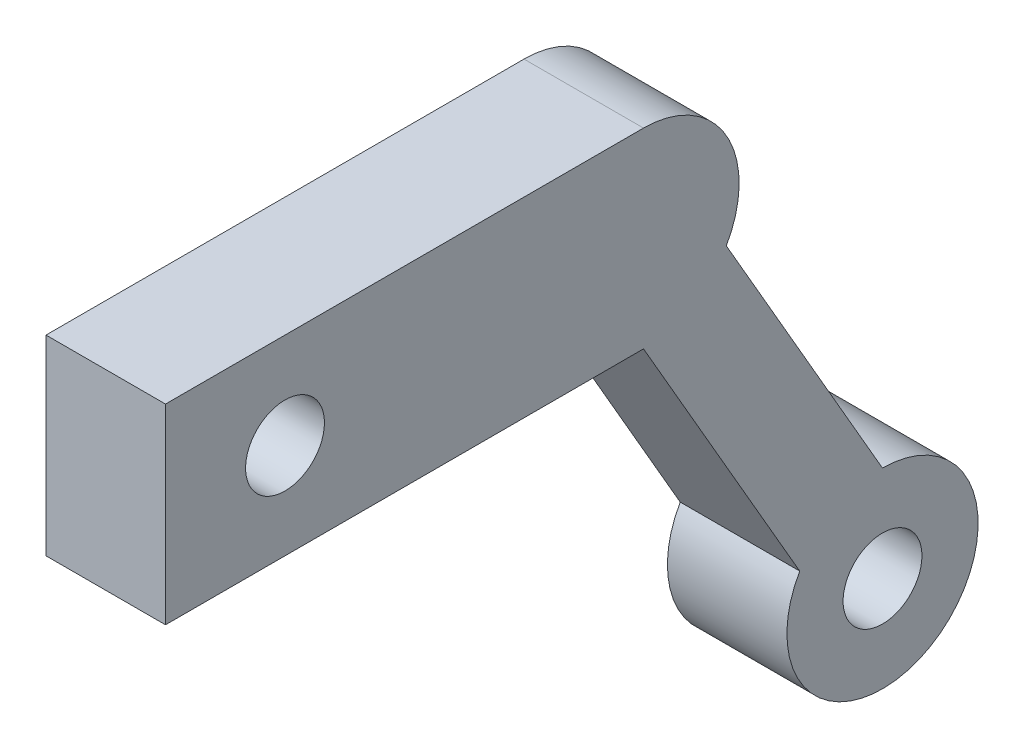
ISO-10303-21;
HEADER;
FILE_DESCRIPTION(('STEP AP214'),'2;1');
FILE_NAME('part.step','',(''),(''),'','','');
FILE_SCHEMA(('AUTOMOTIVE_DESIGN { 1 0 10303 214 1 1 1 1 }'));
ENDSEC;
DATA;
#1=APPLICATION_CONTEXT('core data for automotive mechanical design processes');
#2=APPLICATION_PROTOCOL_DEFINITION('international standard','automotive_design',2000,#1);
#3=PRODUCT_CONTEXT('',#1,'mechanical');
#4=PRODUCT('Part','Part','',(#3));
#5=PRODUCT_RELATED_PRODUCT_CATEGORY('part','',(#4));
#6=PRODUCT_DEFINITION_FORMATION('','',#4);
#7=PRODUCT_DEFINITION_CONTEXT('part definition',#1,'design');
#8=PRODUCT_DEFINITION('design','',#6,#7);
#9=PRODUCT_DEFINITION_SHAPE('','',#8);
#10=(LENGTH_UNIT() NAMED_UNIT(*) SI_UNIT(.MILLI.,.METRE.));
#11=(NAMED_UNIT(*) PLANE_ANGLE_UNIT() SI_UNIT($,.RADIAN.));
#12=(NAMED_UNIT(*) SI_UNIT($,.STERADIAN.) SOLID_ANGLE_UNIT());
#13=UNCERTAINTY_MEASURE_WITH_UNIT(LENGTH_MEASURE(1.E-05),#10,'distance_accuracy_value','');
#14=(GEOMETRIC_REPRESENTATION_CONTEXT(3) GLOBAL_UNCERTAINTY_ASSIGNED_CONTEXT((#13)) GLOBAL_UNIT_ASSIGNED_CONTEXT((#10,
#11,#12)) REPRESENTATION_CONTEXT('',''));
#15=CARTESIAN_POINT('',(0.,0.,0.));
#16=DIRECTION('',(0.,0.,1.));
#17=DIRECTION('',(1.,0.,0.));
#18=AXIS2_PLACEMENT_3D('',#15,#16,#17);
#19=CARTESIAN_POINT('',(5.,-8.,0.));
#20=DIRECTION('',(0.,1.,0.));
#21=DIRECTION('',(0.,0.,1.));
#22=AXIS2_PLACEMENT_3D('',#19,#20,#21);
#23=PLANE('',#22);
#24=DIRECTION('',(0.,0.,-1.));
#25=VECTOR('',#24,1.);
#26=CARTESIAN_POINT('',(0.,-8.,0.));
#27=LINE('',#26,#25);
#28=CARTESIAN_POINT('',(0.,-8.,0.));
#29=VERTEX_POINT('',#28);
#30=CARTESIAN_POINT('',(0.,-8.,-20.));
#31=VERTEX_POINT('',#30);
#32=EDGE_CURVE('E142',#29,#31,#27,.T.);
#33=ORIENTED_EDGE('',*,*,#32,.T.);
#34=DIRECTION('',(-1.,0.,0.));
#35=VECTOR('',#34,1.);
#36=CARTESIAN_POINT('',(5.,-8.,-20.));
#37=LINE('',#36,#35);
#38=CARTESIAN_POINT('',(5.,-8.,-20.));
#39=VERTEX_POINT('',#38);
#40=EDGE_CURVE('E11',#39,#31,#37,.T.);
#41=ORIENTED_EDGE('',*,*,#40,.F.);
#42=DIRECTION('',(0.,0.,-1.));
#43=VECTOR('',#42,1.);
#44=CARTESIAN_POINT('',(5.,-8.,0.));
#45=LINE('',#44,#43);
#46=CARTESIAN_POINT('',(5.,-8.,0.));
#47=VERTEX_POINT('',#46);
#48=EDGE_CURVE('E164',#47,#39,#45,.T.);
#49=ORIENTED_EDGE('',*,*,#48,.F.);
#50=DIRECTION('',(-1.,0.,0.));
#51=VECTOR('',#50,1.);
#52=CARTESIAN_POINT('',(5.,-8.,0.));
#53=LINE('',#52,#51);
#54=EDGE_CURVE('E138',#47,#29,#53,.T.);
#55=ORIENTED_EDGE('',*,*,#54,.T.);
#56=EDGE_LOOP('',(#33,#41,#49,#55));
#57=FACE_BOUND('',#56,.T.);
#58=ADVANCED_FACE('F47',(#57),#23,.F.);
#59=CARTESIAN_POINT('',(5.,6.6602540378444,-11.5358983848622));
#60=DIRECTION('',(0.,0.500000000000002,-0.866025403784438));
#61=DIRECTION('',(0.,0.866025403784438,0.500000000000002));
#62=AXIS2_PLACEMENT_3D('',#59,#60,#61);
#63=PLANE('',#62);
#64=DIRECTION('',(0.,-0.866025403784438,-0.500000000000002));
#65=VECTOR('',#64,1.);
#66=CARTESIAN_POINT('',(0.,6.6602540378444,-11.5358983848622));
#67=LINE('',#66,#65);
#68=CARTESIAN_POINT('',(0.,-19.3205080756887,-26.5358983848623));
#69=VERTEX_POINT('',#68);
#70=EDGE_CURVE('E146',#31,#69,#67,.T.);
#71=ORIENTED_EDGE('',*,*,#70,.T.);
#72=DIRECTION('',(-1.,0.,0.));
#73=VECTOR('',#72,1.);
#74=CARTESIAN_POINT('',(5.,-19.3205080756887,-26.5358983848623));
#75=LINE('',#74,#73);
#76=CARTESIAN_POINT('',(5.,-19.3205080756887,-26.5358983848623));
#77=VERTEX_POINT('',#76);
#78=EDGE_CURVE('E57',#77,#69,#75,.T.);
#79=ORIENTED_EDGE('',*,*,#78,.F.);
#80=DIRECTION('',(0.,-0.866025403784438,-0.500000000000002));
#81=VECTOR('',#80,1.);
#82=CARTESIAN_POINT('',(5.,6.6602540378444,-11.5358983848622));
#83=LINE('',#82,#81);
#84=EDGE_CURVE('E102',#39,#77,#83,.T.);
#85=ORIENTED_EDGE('',*,*,#84,.F.);
#86=ORIENTED_EDGE('',*,*,#40,.T.);
#87=EDGE_LOOP('',(#71,#79,#85,#86));
#88=FACE_BOUND('',#87,.T.);
#89=ADVANCED_FACE('F224',(#88),#63,.F.);
#90=CARTESIAN_POINT('',(5.,-21.3205080756887,-30.));
#91=DIRECTION('',(-1.,0.,0.));
#92=DIRECTION('',(0.,0.,1.));
#93=AXIS2_PLACEMENT_3D('',#90,#91,#92);
#94=CYLINDRICAL_SURFACE('',#93,4.00000000000003);
#95=CARTESIAN_POINT('',(0.,-21.3205080756887,-30.));
#96=DIRECTION('',(1.,0.,0.));
#97=DIRECTION('',(0.,0.,-1.));
#98=AXIS2_PLACEMENT_3D('',#95,#96,#97);
#99=CIRCLE('',#98,4.00000000000003);
#100=CARTESIAN_POINT('',(0.,-17.3205080756888,-30.));
#101=VERTEX_POINT('',#100);
#102=EDGE_CURVE('E149',#69,#101,#99,.T.);
#103=ORIENTED_EDGE('',*,*,#102,.T.);
#104=DIRECTION('',(-1.,0.,0.));
#105=VECTOR('',#104,1.);
#106=CARTESIAN_POINT('',(5.,-17.3205080756888,-30.));
#107=LINE('',#106,#105);
#108=CARTESIAN_POINT('',(5.,-17.3205080756888,-30.));
#109=VERTEX_POINT('',#108);
#110=EDGE_CURVE('E171',#109,#101,#107,.T.);
#111=ORIENTED_EDGE('',*,*,#110,.F.);
#112=CARTESIAN_POINT('',(5.,-21.3205080756887,-30.));
#113=DIRECTION('',(1.,0.,0.));
#114=DIRECTION('',(0.,0.,-1.));
#115=AXIS2_PLACEMENT_3D('',#112,#113,#114);
#116=CIRCLE('',#115,4.00000000000003);
#117=EDGE_CURVE('E198',#77,#109,#116,.T.);
#118=ORIENTED_EDGE('',*,*,#117,.F.);
#119=ORIENTED_EDGE('',*,*,#78,.T.);
#120=EDGE_LOOP('',(#103,#111,#118,#119));
#121=FACE_BOUND('',#120,.T.);
#122=ADVANCED_FACE('F228',(#121),#94,.T.);
#123=CARTESIAN_POINT('',(5.,8.6602540378444,-15.));
#124=DIRECTION('',(0.,0.500000000000001,-0.866025403784438));
#125=DIRECTION('',(0.,0.866025403784438,0.500000000000001));
#126=AXIS2_PLACEMENT_3D('',#123,#124,#125);
#127=PLANE('',#126);
#128=DIRECTION('',(0.,-0.866025403784438,-0.500000000000001));
#129=VECTOR('',#128,1.);
#130=CARTESIAN_POINT('',(0.,8.6602540378444,-15.));
#131=LINE('',#130,#129);
#132=CARTESIAN_POINT('',(0.,-5.99999999999997,-23.4641016151378));
#133=VERTEX_POINT('',#132);
#134=EDGE_CURVE('E153',#133,#101,#131,.T.);
#135=ORIENTED_EDGE('',*,*,#134,.F.);
#136=DIRECTION('',(-1.,0.,0.));
#137=VECTOR('',#136,1.);
#138=CARTESIAN_POINT('',(5.,-5.99999999999997,-23.4641016151378));
#139=LINE('',#138,#137);
#140=CARTESIAN_POINT('',(5.,-5.99999999999997,-23.4641016151378));
#141=VERTEX_POINT('',#140);
#142=EDGE_CURVE('E132',#141,#133,#139,.T.);
#143=ORIENTED_EDGE('',*,*,#142,.F.);
#144=DIRECTION('',(0.,-0.866025403784438,-0.500000000000001));
#145=VECTOR('',#144,1.);
#146=CARTESIAN_POINT('',(5.,8.6602540378444,-15.));
#147=LINE('',#146,#145);
#148=EDGE_CURVE('E119',#141,#109,#147,.T.);
#149=ORIENTED_EDGE('',*,*,#148,.T.);
#150=ORIENTED_EDGE('',*,*,#110,.T.);
#151=EDGE_LOOP('',(#135,#143,#149,#150));
#152=FACE_BOUND('',#151,.T.);
#153=ADVANCED_FACE('F203',(#152),#127,.T.);
#154=CARTESIAN_POINT('',(5.,-3.99999999999999,-20.));
#155=DIRECTION('',(-1.,0.,0.));
#156=DIRECTION('',(0.,0.,1.));
#157=AXIS2_PLACEMENT_3D('',#154,#155,#156);
#158=CYLINDRICAL_SURFACE('',#157,3.99999999999999);
#159=CARTESIAN_POINT('',(0.,-3.99999999999999,-20.));
#160=DIRECTION('',(1.,0.,0.));
#161=DIRECTION('',(0.,0.,-1.));
#162=AXIS2_PLACEMENT_3D('',#159,#160,#161);
#163=CIRCLE('',#162,3.99999999999999);
#164=CARTESIAN_POINT('',(0.,0.,-20.));
#165=VERTEX_POINT('',#164);
#166=EDGE_CURVE('E127',#133,#165,#163,.T.);
#167=ORIENTED_EDGE('',*,*,#166,.T.);
#168=DIRECTION('',(-1.,0.,0.));
#169=VECTOR('',#168,1.);
#170=CARTESIAN_POINT('',(5.,0.,-20.));
#171=LINE('',#170,#169);
#172=CARTESIAN_POINT('',(5.,0.,-20.));
#173=VERTEX_POINT('',#172);
#174=EDGE_CURVE('E124',#173,#165,#171,.T.);
#175=ORIENTED_EDGE('',*,*,#174,.F.);
#176=CARTESIAN_POINT('',(5.,-3.99999999999999,-20.));
#177=DIRECTION('',(1.,0.,0.));
#178=DIRECTION('',(0.,0.,-1.));
#179=AXIS2_PLACEMENT_3D('',#176,#177,#178);
#180=CIRCLE('',#179,3.99999999999999);
#181=EDGE_CURVE('E113',#141,#173,#180,.T.);
#182=ORIENTED_EDGE('',*,*,#181,.F.);
#183=ORIENTED_EDGE('',*,*,#142,.T.);
#184=EDGE_LOOP('',(#167,#175,#182,#183));
#185=FACE_BOUND('',#184,.T.);
#186=ADVANCED_FACE('F125',(#185),#158,.T.);
#187=CARTESIAN_POINT('',(5.,0.,0.));
#188=DIRECTION('',(0.,1.,0.));
#189=DIRECTION('',(0.,0.,1.));
#190=AXIS2_PLACEMENT_3D('',#187,#188,#189);
#191=PLANE('',#190);
#192=DIRECTION('',(0.,0.,-1.));
#193=VECTOR('',#192,1.);
#194=CARTESIAN_POINT('',(0.,0.,0.));
#195=LINE('',#194,#193);
#196=CARTESIAN_POINT('',(0.,0.,0.));
#197=VERTEX_POINT('',#196);
#198=EDGE_CURVE('E159',#197,#165,#195,.T.);
#199=ORIENTED_EDGE('',*,*,#198,.F.);
#200=DIRECTION('',(-1.,0.,0.));
#201=VECTOR('',#200,1.);
#202=CARTESIAN_POINT('',(5.,0.,0.));
#203=LINE('',#202,#201);
#204=CARTESIAN_POINT('',(5.,0.,0.));
#205=VERTEX_POINT('',#204);
#206=EDGE_CURVE('E91',#205,#197,#203,.T.);
#207=ORIENTED_EDGE('',*,*,#206,.F.);
#208=DIRECTION('',(0.,0.,-1.));
#209=VECTOR('',#208,1.);
#210=CARTESIAN_POINT('',(5.,0.,0.));
#211=LINE('',#210,#209);
#212=EDGE_CURVE('E117',#205,#173,#211,.T.);
#213=ORIENTED_EDGE('',*,*,#212,.T.);
#214=ORIENTED_EDGE('',*,*,#174,.T.);
#215=EDGE_LOOP('',(#199,#207,#213,#214));
#216=FACE_BOUND('',#215,.T.);
#217=ADVANCED_FACE('F134',(#216),#191,.T.);
#218=CARTESIAN_POINT('',(5.,0.,0.));
#219=DIRECTION('',(0.,0.,-1.));
#220=DIRECTION('',(0.,1.,0.));
#221=AXIS2_PLACEMENT_3D('',#218,#219,#220);
#222=PLANE('',#221);
#223=DIRECTION('',(0.,-1.,0.));
#224=VECTOR('',#223,1.);
#225=CARTESIAN_POINT('',(0.,0.,0.));
#226=LINE('',#225,#224);
#227=EDGE_CURVE('E94',#197,#29,#226,.T.);
#228=ORIENTED_EDGE('',*,*,#227,.T.);
#229=ORIENTED_EDGE('',*,*,#54,.F.);
#230=DIRECTION('',(0.,-1.,0.));
#231=VECTOR('',#230,1.);
#232=CARTESIAN_POINT('',(5.,0.,0.));
#233=LINE('',#232,#231);
#234=EDGE_CURVE('E66',#205,#47,#233,.T.);
#235=ORIENTED_EDGE('',*,*,#234,.F.);
#236=ORIENTED_EDGE('',*,*,#206,.T.);
#237=EDGE_LOOP('',(#228,#229,#235,#236));
#238=FACE_BOUND('',#237,.T.);
#239=ADVANCED_FACE('F212',(#238),#222,.F.);
#240=CARTESIAN_POINT('',(5.,0.,0.));
#241=DIRECTION('',(1.,0.,0.));
#242=DIRECTION('',(0.,0.,-1.));
#243=AXIS2_PLACEMENT_3D('',#240,#241,#242);
#244=PLANE('',#243);
#245=CARTESIAN_POINT('',(5.,-4.,-5.));
#246=DIRECTION('',(1.,0.,0.));
#247=DIRECTION('',(0.,0.,-1.));
#248=AXIS2_PLACEMENT_3D('',#245,#246,#247);
#249=CIRCLE('',#248,1.65);
#250=CARTESIAN_POINT('',(5.,-4.,-6.65));
#251=VERTEX_POINT('',#250);
#252=EDGE_CURVE('E179',#251,#251,#249,.T.);
#253=ORIENTED_EDGE('',*,*,#252,.F.);
#254=EDGE_LOOP('',(#253));
#255=FACE_BOUND('',#254,.T.);
#256=CARTESIAN_POINT('',(5.,-21.3205080756887,-30.));
#257=DIRECTION('',(1.,0.,0.));
#258=DIRECTION('',(0.,0.,-1.));
#259=AXIS2_PLACEMENT_3D('',#256,#257,#258);
#260=CIRCLE('',#259,1.65);
#261=CARTESIAN_POINT('',(5.,-21.3205080756887,-31.65));
#262=VERTEX_POINT('',#261);
#263=EDGE_CURVE('E186',#262,#262,#260,.T.);
#264=ORIENTED_EDGE('',*,*,#263,.F.);
#265=EDGE_LOOP('',(#264));
#266=FACE_BOUND('',#265,.T.);
#267=ORIENTED_EDGE('',*,*,#48,.T.);
#268=ORIENTED_EDGE('',*,*,#84,.T.);
#269=ORIENTED_EDGE('',*,*,#117,.T.);
#270=ORIENTED_EDGE('',*,*,#148,.F.);
#271=ORIENTED_EDGE('',*,*,#181,.T.);
#272=ORIENTED_EDGE('',*,*,#212,.F.);
#273=ORIENTED_EDGE('',*,*,#234,.T.);
#274=EDGE_LOOP('',(#267,#268,#269,#270,#271,#272,#273));
#275=FACE_BOUND('',#274,.T.);
#276=ADVANCED_FACE('F115',(#255,#266,#275),#244,.T.);
#277=CARTESIAN_POINT('',(0.,0.,0.));
#278=DIRECTION('',(1.,0.,0.));
#279=DIRECTION('',(0.,0.,-1.));
#280=AXIS2_PLACEMENT_3D('',#277,#278,#279);
#281=PLANE('',#280);
#282=CARTESIAN_POINT('',(0.,-4.,-5.));
#283=DIRECTION('',(1.,0.,0.));
#284=DIRECTION('',(0.,0.,-1.));
#285=AXIS2_PLACEMENT_3D('',#282,#283,#284);
#286=CIRCLE('',#285,1.65);
#287=CARTESIAN_POINT('',(0.,-4.,-6.65));
#288=VERTEX_POINT('',#287);
#289=EDGE_CURVE('E50',#288,#288,#286,.T.);
#290=ORIENTED_EDGE('',*,*,#289,.T.);
#291=EDGE_LOOP('',(#290));
#292=FACE_BOUND('',#291,.T.);
#293=CARTESIAN_POINT('',(0.,-21.3205080756887,-30.));
#294=DIRECTION('',(1.,0.,0.));
#295=DIRECTION('',(0.,0.,-1.));
#296=AXIS2_PLACEMENT_3D('',#293,#294,#295);
#297=CIRCLE('',#296,1.65);
#298=CARTESIAN_POINT('',(0.,-21.3205080756887,-31.65));
#299=VERTEX_POINT('',#298);
#300=EDGE_CURVE('E176',#299,#299,#297,.T.);
#301=ORIENTED_EDGE('',*,*,#300,.T.);
#302=EDGE_LOOP('',(#301));
#303=FACE_BOUND('',#302,.T.);
#304=ORIENTED_EDGE('',*,*,#32,.F.);
#305=ORIENTED_EDGE('',*,*,#227,.F.);
#306=ORIENTED_EDGE('',*,*,#198,.T.);
#307=ORIENTED_EDGE('',*,*,#166,.F.);
#308=ORIENTED_EDGE('',*,*,#134,.T.);
#309=ORIENTED_EDGE('',*,*,#102,.F.);
#310=ORIENTED_EDGE('',*,*,#70,.F.);
#311=EDGE_LOOP('',(#304,#305,#306,#307,#308,#309,#310));
#312=FACE_BOUND('',#311,.T.);
#313=ADVANCED_FACE('F207',(#292,#303,#312),#281,.F.);
#314=CARTESIAN_POINT('',(-5.,-21.3205080756887,-30.));
#315=DIRECTION('',(1.,0.,0.));
#316=DIRECTION('',(0.,0.,-1.));
#317=AXIS2_PLACEMENT_3D('',#314,#315,#316);
#318=CYLINDRICAL_SURFACE('',#317,1.65);
#319=ORIENTED_EDGE('',*,*,#263,.T.);
#320=EDGE_LOOP('',(#319));
#321=FACE_BOUND('',#320,.T.);
#322=ORIENTED_EDGE('',*,*,#300,.F.);
#323=EDGE_LOOP('',(#322));
#324=FACE_BOUND('',#323,.T.);
#325=ADVANCED_FACE('F279',(#321,#324),#318,.F.);
#326=CARTESIAN_POINT('',(-5.,-4.,-5.));
#327=DIRECTION('',(1.,0.,0.));
#328=DIRECTION('',(0.,0.,-1.));
#329=AXIS2_PLACEMENT_3D('',#326,#327,#328);
#330=CYLINDRICAL_SURFACE('',#329,1.65);
#331=ORIENTED_EDGE('',*,*,#252,.T.);
#332=EDGE_LOOP('',(#331));
#333=FACE_BOUND('',#332,.T.);
#334=ORIENTED_EDGE('',*,*,#289,.F.);
#335=EDGE_LOOP('',(#334));
#336=FACE_BOUND('',#335,.T.);
#337=ADVANCED_FACE('F300',(#333,#336),#330,.F.);
#338=CLOSED_SHELL('',(#58,#89,#122,#153,#186,#217,#239,#276,#313,#325,#337));
#339=MANIFOLD_SOLID_BREP('B2',#338);
#340=ADVANCED_BREP_SHAPE_REPRESENTATION('',(#18,#339),#14);
#341=SHAPE_DEFINITION_REPRESENTATION(#9,#340);
ENDSEC;
END-ISO-10303-21;
